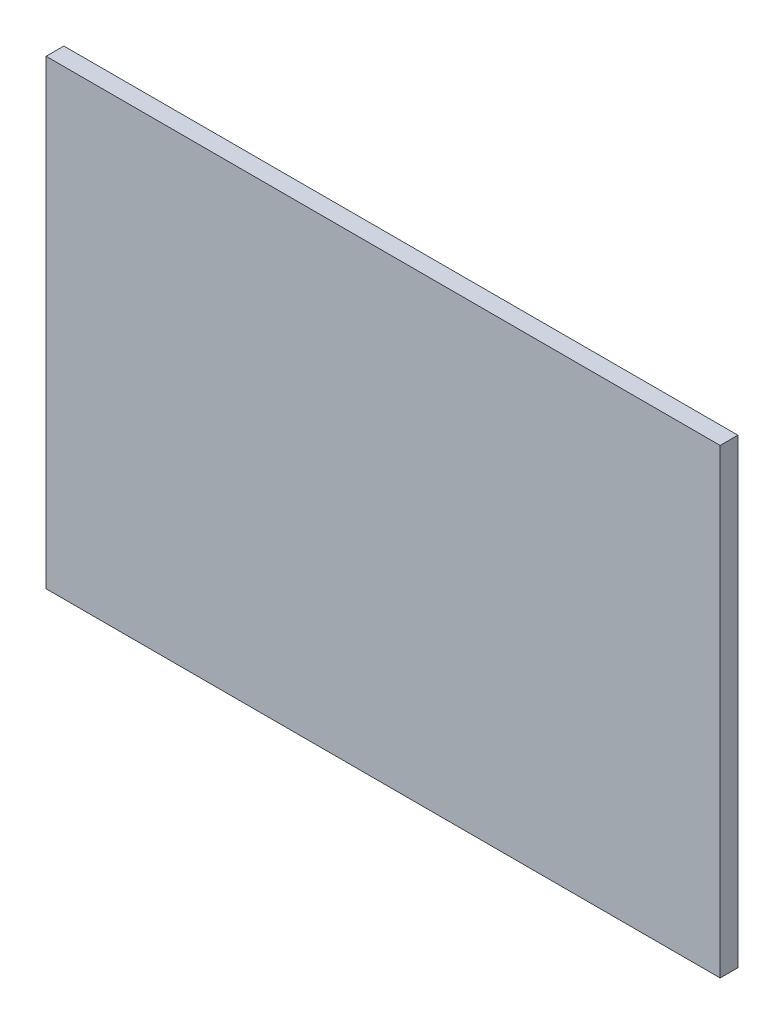
ISO-10303-21;
HEADER;
FILE_DESCRIPTION(('STEP AP214'),'2;1');
FILE_NAME('part.step','',(''),(''),'','','');
FILE_SCHEMA(('AUTOMOTIVE_DESIGN { 1 0 10303 214 1 1 1 1 }'));
ENDSEC;
DATA;
#1=APPLICATION_CONTEXT('core data for automotive mechanical design processes');
#2=APPLICATION_PROTOCOL_DEFINITION('international standard','automotive_design',2000,#1);
#3=PRODUCT_CONTEXT('',#1,'mechanical');
#4=PRODUCT('Part','Part','',(#3));
#5=PRODUCT_RELATED_PRODUCT_CATEGORY('part','',(#4));
#6=PRODUCT_DEFINITION_FORMATION('','',#4);
#7=PRODUCT_DEFINITION_CONTEXT('part definition',#1,'design');
#8=PRODUCT_DEFINITION('design','',#6,#7);
#9=PRODUCT_DEFINITION_SHAPE('','',#8);
#10=(LENGTH_UNIT() NAMED_UNIT(*) SI_UNIT(.MILLI.,.METRE.));
#11=(NAMED_UNIT(*) PLANE_ANGLE_UNIT() SI_UNIT($,.RADIAN.));
#12=(NAMED_UNIT(*) SI_UNIT($,.STERADIAN.) SOLID_ANGLE_UNIT());
#13=UNCERTAINTY_MEASURE_WITH_UNIT(LENGTH_MEASURE(1.E-05),#10,'distance_accuracy_value','');
#14=(GEOMETRIC_REPRESENTATION_CONTEXT(3) GLOBAL_UNCERTAINTY_ASSIGNED_CONTEXT((#13)) GLOBAL_UNIT_ASSIGNED_CONTEXT((#10,
#11,#12)) REPRESENTATION_CONTEXT('',''));
#15=CARTESIAN_POINT('',(0.,0.,0.));
#16=DIRECTION('',(0.,0.,1.));
#17=DIRECTION('',(1.,0.,0.));
#18=AXIS2_PLACEMENT_3D('',#15,#16,#17);
#19=CARTESIAN_POINT('',(19.,-13.,1.));
#20=DIRECTION('',(-1.,0.,0.));
#21=DIRECTION('',(0.,0.,1.));
#22=AXIS2_PLACEMENT_3D('',#19,#20,#21);
#23=PLANE('',#22);
#24=DIRECTION('',(0.,1.,0.));
#25=VECTOR('',#24,1.);
#26=CARTESIAN_POINT('',(19.,-13.,0.));
#27=LINE('',#26,#25);
#28=CARTESIAN_POINT('',(19.,-13.,0.));
#29=VERTEX_POINT('',#28);
#30=CARTESIAN_POINT('',(19.,13.,0.));
#31=VERTEX_POINT('',#30);
#32=EDGE_CURVE('E97',#29,#31,#27,.T.);
#33=ORIENTED_EDGE('',*,*,#32,.T.);
#34=DIRECTION('',(0.,0.,-1.));
#35=VECTOR('',#34,1.);
#36=CARTESIAN_POINT('',(19.,13.,1.));
#37=LINE('',#36,#35);
#38=CARTESIAN_POINT('',(19.,13.,1.));
#39=VERTEX_POINT('',#38);
#40=EDGE_CURVE('E11',#39,#31,#37,.T.);
#41=ORIENTED_EDGE('',*,*,#40,.F.);
#42=DIRECTION('',(0.,1.,0.));
#43=VECTOR('',#42,1.);
#44=CARTESIAN_POINT('',(19.,-13.,1.));
#45=LINE('',#44,#43);
#46=CARTESIAN_POINT('',(19.,-13.,1.));
#47=VERTEX_POINT('',#46);
#48=EDGE_CURVE('E85',#47,#39,#45,.T.);
#49=ORIENTED_EDGE('',*,*,#48,.F.);
#50=DIRECTION('',(0.,0.,-1.));
#51=VECTOR('',#50,1.);
#52=CARTESIAN_POINT('',(19.,-13.,1.));
#53=LINE('',#52,#51);
#54=EDGE_CURVE('E93',#47,#29,#53,.T.);
#55=ORIENTED_EDGE('',*,*,#54,.T.);
#56=EDGE_LOOP('',(#33,#41,#49,#55));
#57=FACE_BOUND('',#56,.T.);
#58=ADVANCED_FACE('F34',(#57),#23,.F.);
#59=CARTESIAN_POINT('',(-19.,13.,1.));
#60=DIRECTION('',(0.,-1.,0.));
#61=DIRECTION('',(0.,0.,-1.));
#62=AXIS2_PLACEMENT_3D('',#59,#60,#61);
#63=PLANE('',#62);
#64=DIRECTION('',(-1.,0.,0.));
#65=VECTOR('',#64,1.);
#66=CARTESIAN_POINT('',(-19.,13.,0.));
#67=LINE('',#66,#65);
#68=CARTESIAN_POINT('',(-19.,13.,0.));
#69=VERTEX_POINT('',#68);
#70=EDGE_CURVE('E89',#31,#69,#67,.T.);
#71=ORIENTED_EDGE('',*,*,#70,.T.);
#72=DIRECTION('',(0.,0.,-1.));
#73=VECTOR('',#72,1.);
#74=CARTESIAN_POINT('',(-19.,13.,1.));
#75=LINE('',#74,#73);
#76=CARTESIAN_POINT('',(-19.,13.,1.));
#77=VERTEX_POINT('',#76);
#78=EDGE_CURVE('E42',#77,#69,#75,.T.);
#79=ORIENTED_EDGE('',*,*,#78,.F.);
#80=DIRECTION('',(-1.,0.,0.));
#81=VECTOR('',#80,1.);
#82=CARTESIAN_POINT('',(-19.,13.,1.));
#83=LINE('',#82,#81);
#84=EDGE_CURVE('E80',#39,#77,#83,.T.);
#85=ORIENTED_EDGE('',*,*,#84,.F.);
#86=ORIENTED_EDGE('',*,*,#40,.T.);
#87=EDGE_LOOP('',(#71,#79,#85,#86));
#88=FACE_BOUND('',#87,.T.);
#89=ADVANCED_FACE('F88',(#88),#63,.F.);
#90=CARTESIAN_POINT('',(-19.,-13.,1.));
#91=DIRECTION('',(1.,0.,0.));
#92=DIRECTION('',(0.,0.,-1.));
#93=AXIS2_PLACEMENT_3D('',#90,#91,#92);
#94=PLANE('',#93);
#95=DIRECTION('',(0.,-1.,0.));
#96=VECTOR('',#95,1.);
#97=CARTESIAN_POINT('',(-19.,-13.,0.));
#98=LINE('',#97,#96);
#99=CARTESIAN_POINT('',(-19.,-13.,0.));
#100=VERTEX_POINT('',#99);
#101=EDGE_CURVE('E67',#69,#100,#98,.T.);
#102=ORIENTED_EDGE('',*,*,#101,.T.);
#103=DIRECTION('',(0.,0.,-1.));
#104=VECTOR('',#103,1.);
#105=CARTESIAN_POINT('',(-19.,-13.,1.));
#106=LINE('',#105,#104);
#107=CARTESIAN_POINT('',(-19.,-13.,1.));
#108=VERTEX_POINT('',#107);
#109=EDGE_CURVE('E90',#108,#100,#106,.T.);
#110=ORIENTED_EDGE('',*,*,#109,.F.);
#111=DIRECTION('',(0.,-1.,0.));
#112=VECTOR('',#111,1.);
#113=CARTESIAN_POINT('',(-19.,-13.,1.));
#114=LINE('',#113,#112);
#115=EDGE_CURVE('E83',#77,#108,#114,.T.);
#116=ORIENTED_EDGE('',*,*,#115,.F.);
#117=ORIENTED_EDGE('',*,*,#78,.T.);
#118=EDGE_LOOP('',(#102,#110,#116,#117));
#119=FACE_BOUND('',#118,.T.);
#120=ADVANCED_FACE('F91',(#119),#94,.F.);
#121=CARTESIAN_POINT('',(-19.,-13.,1.));
#122=DIRECTION('',(0.,1.,0.));
#123=DIRECTION('',(0.,0.,1.));
#124=AXIS2_PLACEMENT_3D('',#121,#122,#123);
#125=PLANE('',#124);
#126=DIRECTION('',(1.,0.,0.));
#127=VECTOR('',#126,1.);
#128=CARTESIAN_POINT('',(-19.,-13.,0.));
#129=LINE('',#128,#127);
#130=EDGE_CURVE('E73',#100,#29,#129,.T.);
#131=ORIENTED_EDGE('',*,*,#130,.T.);
#132=ORIENTED_EDGE('',*,*,#54,.F.);
#133=DIRECTION('',(1.,0.,0.));
#134=VECTOR('',#133,1.);
#135=CARTESIAN_POINT('',(-19.,-13.,1.));
#136=LINE('',#135,#134);
#137=EDGE_CURVE('E50',#108,#47,#136,.T.);
#138=ORIENTED_EDGE('',*,*,#137,.F.);
#139=ORIENTED_EDGE('',*,*,#109,.T.);
#140=EDGE_LOOP('',(#131,#132,#138,#139));
#141=FACE_BOUND('',#140,.T.);
#142=ADVANCED_FACE('F104',(#141),#125,.F.);
#143=CARTESIAN_POINT('',(0.,0.,1.));
#144=DIRECTION('',(0.,0.,-1.));
#145=DIRECTION('',(-1.,0.,0.));
#146=AXIS2_PLACEMENT_3D('',#143,#144,#145);
#147=PLANE('',#146);
#148=ORIENTED_EDGE('',*,*,#48,.T.);
#149=ORIENTED_EDGE('',*,*,#84,.T.);
#150=ORIENTED_EDGE('',*,*,#115,.T.);
#151=ORIENTED_EDGE('',*,*,#137,.T.);
#152=EDGE_LOOP('',(#148,#149,#150,#151));
#153=FACE_BOUND('',#152,.T.);
#154=ADVANCED_FACE('F81',(#153),#147,.F.);
#155=CARTESIAN_POINT('',(0.,0.,0.));
#156=DIRECTION('',(0.,0.,-1.));
#157=DIRECTION('',(-1.,0.,0.));
#158=AXIS2_PLACEMENT_3D('',#155,#156,#157);
#159=PLANE('',#158);
#160=ORIENTED_EDGE('',*,*,#32,.F.);
#161=ORIENTED_EDGE('',*,*,#130,.F.);
#162=ORIENTED_EDGE('',*,*,#101,.F.);
#163=ORIENTED_EDGE('',*,*,#70,.F.);
#164=EDGE_LOOP('',(#160,#161,#162,#163));
#165=FACE_BOUND('',#164,.T.);
#166=ADVANCED_FACE('F107',(#165),#159,.T.);
#167=CLOSED_SHELL('',(#58,#89,#120,#142,#154,#166));
#168=MANIFOLD_SOLID_BREP('B2',#167);
#169=ADVANCED_BREP_SHAPE_REPRESENTATION('',(#18,#168),#14);
#170=SHAPE_DEFINITION_REPRESENTATION(#9,#169);
ENDSEC;
END-ISO-10303-21;
